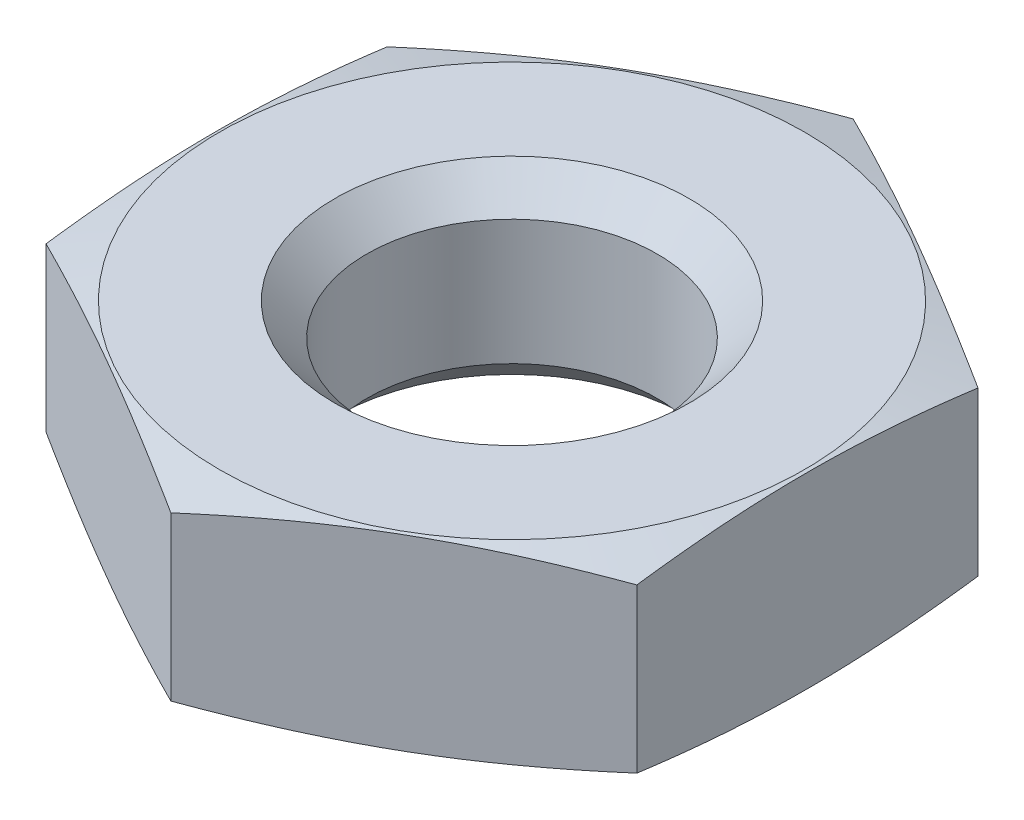
ISO-10303-21;
HEADER;
FILE_DESCRIPTION(('STEP AP214'),'2;1');
FILE_NAME('part.step','',(''),(''),'','','');
FILE_SCHEMA(('AUTOMOTIVE_DESIGN { 1 0 10303 214 1 1 1 1 }'));
ENDSEC;
DATA;
#1=APPLICATION_CONTEXT('core data for automotive mechanical design processes');
#2=APPLICATION_PROTOCOL_DEFINITION('international standard','automotive_design',2000,#1);
#3=PRODUCT_CONTEXT('',#1,'mechanical');
#4=PRODUCT('Part','Part','',(#3));
#5=PRODUCT_RELATED_PRODUCT_CATEGORY('part','',(#4));
#6=PRODUCT_DEFINITION_FORMATION('','',#4);
#7=PRODUCT_DEFINITION_CONTEXT('part definition',#1,'design');
#8=PRODUCT_DEFINITION('design','',#6,#7);
#9=PRODUCT_DEFINITION_SHAPE('','',#8);
#10=(LENGTH_UNIT() NAMED_UNIT(*) SI_UNIT(.MILLI.,.METRE.));
#11=(NAMED_UNIT(*) PLANE_ANGLE_UNIT() SI_UNIT($,.RADIAN.));
#12=(NAMED_UNIT(*) SI_UNIT($,.STERADIAN.) SOLID_ANGLE_UNIT());
#13=UNCERTAINTY_MEASURE_WITH_UNIT(LENGTH_MEASURE(1.E-05),#10,'distance_accuracy_value','');
#14=(GEOMETRIC_REPRESENTATION_CONTEXT(3) GLOBAL_UNCERTAINTY_ASSIGNED_CONTEXT((#13)) GLOBAL_UNIT_ASSIGNED_CONTEXT((#10,
#11,#12)) REPRESENTATION_CONTEXT('',''));
#15=CARTESIAN_POINT('',(0.,0.,0.));
#16=DIRECTION('',(0.,0.,1.));
#17=DIRECTION('',(1.,0.,0.));
#18=AXIS2_PLACEMENT_3D('',#15,#16,#17);
#19=CARTESIAN_POINT('',(0.,0.,0.));
#20=DIRECTION('',(0.,1.,0.));
#21=DIRECTION('',(0.,0.,1.));
#22=AXIS2_PLACEMENT_3D('',#19,#20,#21);
#23=PLANE('',#22);
#24=CARTESIAN_POINT('',(0.,0.,0.));
#25=DIRECTION('',(0.,-1.,0.));
#26=DIRECTION('',(0.,0.,-1.));
#27=AXIS2_PLACEMENT_3D('',#24,#25,#26);
#28=CIRCLE('',#27,4.95);
#29=CARTESIAN_POINT('',(0.,0.,-4.95));
#30=VERTEX_POINT('',#29);
#31=EDGE_CURVE('E114',#30,#30,#28,.T.);
#32=ORIENTED_EDGE('',*,*,#31,.F.);
#33=EDGE_LOOP('',(#32));
#34=FACE_BOUND('',#33,.T.);
#35=CARTESIAN_POINT('',(0.,0.,0.));
#36=DIRECTION('',(0.,1.,0.));
#37=DIRECTION('',(0.,0.,1.));
#38=AXIS2_PLACEMENT_3D('',#35,#36,#37);
#39=CIRCLE('',#38,3.);
#40=CARTESIAN_POINT('',(0.,0.,3.));
#41=VERTEX_POINT('',#40);
#42=EDGE_CURVE('E105',#41,#41,#39,.T.);
#43=ORIENTED_EDGE('',*,*,#42,.F.);
#44=EDGE_LOOP('',(#43));
#45=FACE_BOUND('',#44,.T.);
#46=ADVANCED_FACE('F36',(#34,#45),#23,.T.);
#47=CARTESIAN_POINT('',(4.95,-3.2,0.));
#48=DIRECTION('',(0.,-1.,0.));
#49=DIRECTION('',(0.,0.,-1.));
#50=AXIS2_PLACEMENT_3D('',#47,#48,#49);
#51=PLANE('',#50);
#52=CARTESIAN_POINT('',(0.,-3.2,0.));
#53=DIRECTION('',(0.,-1.,0.));
#54=DIRECTION('',(0.,0.,-1.));
#55=AXIS2_PLACEMENT_3D('',#52,#53,#54);
#56=CIRCLE('',#55,4.95);
#57=CARTESIAN_POINT('',(0.,-3.2,-4.95));
#58=VERTEX_POINT('',#57);
#59=EDGE_CURVE('E111',#58,#58,#56,.T.);
#60=ORIENTED_EDGE('',*,*,#59,.T.);
#61=EDGE_LOOP('',(#60));
#62=FACE_BOUND('',#61,.T.);
#63=CARTESIAN_POINT('',(0.,-3.2,0.));
#64=DIRECTION('',(0.,1.,0.));
#65=DIRECTION('',(0.,0.,1.));
#66=AXIS2_PLACEMENT_3D('',#63,#64,#65);
#67=CIRCLE('',#66,3.);
#68=CARTESIAN_POINT('',(0.,-3.2,3.));
#69=VERTEX_POINT('',#68);
#70=EDGE_CURVE('E348',#69,#69,#67,.T.);
#71=ORIENTED_EDGE('',*,*,#70,.T.);
#72=EDGE_LOOP('',(#71));
#73=FACE_BOUND('',#72,.T.);
#74=ADVANCED_FACE('F137',(#62,#73),#51,.T.);
#75=CARTESIAN_POINT('',(0.,-1.6,0.));
#76=DIRECTION('',(0.,-1.,0.));
#77=DIRECTION('',(0.,0.,-1.));
#78=AXIS2_PLACEMENT_3D('',#75,#76,#77);
#79=CONICAL_SURFACE('',#78,10.92128129211,1.30899693899574);
#80=ORIENTED_EDGE('',*,*,#31,.T.);
#81=EDGE_LOOP('',(#80));
#82=FACE_BOUND('',#81,.T.);
#83=CARTESIAN_POINT('',(0.000200000000000056,-0.220687822294338,-5.77361816195014));
#84=CARTESIAN_POINT('',(-0.207454004305664,-0.188549555804581,-5.65372906666596));
#85=CARTESIAN_POINT('',(-0.415484518325708,-0.159373272645011,-5.53362259339683));
#86=CARTESIAN_POINT('',(-0.832280248969818,-0.108113229801624,-5.29298546611236));
#87=CARTESIAN_POINT('',(-1.04104572932974,-0.0860323511907302,-5.17245465982905));
#88=CARTESIAN_POINT('',(-1.45804559853969,-0.0502522274677594,-4.93169967308864));
#89=CARTESIAN_POINT('',(-1.66627716741308,-0.0365103114883495,-4.81147712074581));
#90=CARTESIAN_POINT('',(-2.08300586365708,-0.0180838038255081,-4.57087869579028));
#91=CARTESIAN_POINT('',(-2.29150293182854,-0.0133974596215596,-4.45050285735624));
#92=CARTESIAN_POINT('',(-2.70849706817146,-0.013397459621558,-4.20975118048816));
#93=CARTESIAN_POINT('',(-2.91699413634291,-0.018083803825505,-4.08937534205412));
#94=CARTESIAN_POINT('',(-3.33372283258692,-0.0365103114883436,-3.84877691709859));
#95=CARTESIAN_POINT('',(-3.54195440146031,-0.0502522274677522,-3.72855436475576));
#96=CARTESIAN_POINT('',(-3.95895427067026,-0.0860323511907204,-3.48779937801535));
#97=CARTESIAN_POINT('',(-4.16771975103018,-0.108113229801612,-3.36726857173205));
#98=CARTESIAN_POINT('',(-4.58451548167429,-0.159373272644997,-3.12663144444758));
#99=CARTESIAN_POINT('',(-4.79254599569433,-0.188549555804566,-3.00652497117844));
#100=CARTESIAN_POINT('',(-5.0002,-0.220687822294322,-2.88663587589426));
#101=B_SPLINE_CURVE_WITH_KNOTS('',3,(#83,#84,#85,#86,#87,#88,#89,#90,#91,#92,#93,#94,#95,#96,
#97,#98,#99,#100),.UNSPECIFIED.,.F.,.F.,(4,2,2,2,2,2,2,2,4),(0.,0.725805237679813,
1.45190481561533,2.17425686883393,2.89646911159518,3.61868135435642,4.34103340757503,
5.06713298551055,5.79293822319036),.UNSPECIFIED.);
#102=CARTESIAN_POINT('',(0.,-0.220656881258476,-5.7735026918963));
#103=VERTEX_POINT('',#102);
#104=CARTESIAN_POINT('',(-5.,-0.220656881258461,-2.8867513459481));
#105=VERTEX_POINT('',#104);
#106=EDGE_CURVE('E110',#103,#105,#101,.T.);
#107=ORIENTED_EDGE('',*,*,#106,.T.);
#108=CARTESIAN_POINT('',(-5.,-1.14063800462012,-7.73093508057312));
#109=CARTESIAN_POINT('',(-5.,-1.08936240000554,-7.50297701689983));
#110=CARTESIAN_POINT('',(-5.,-1.03869834678135,-7.27487894610606));
#111=CARTESIAN_POINT('',(-5.,-0.938923659771285,-6.81833381184379));
#112=CARTESIAN_POINT('',(-5.,-0.88981309034785,-6.58988673432556));
#113=CARTESIAN_POINT('',(-5.,-0.793435996769751,-6.13238464648103));
#114=CARTESIAN_POINT('',(-5.,-0.746171197688716,-5.90332927148686));
#115=CARTESIAN_POINT('',(-5.,-0.653980649652257,-5.44474852289208));
#116=CARTESIAN_POINT('',(-5.,-0.609054881867156,-5.21522315309048));
#117=CARTESIAN_POINT('',(-5.,-0.522457178467669,-4.75749916393179));
#118=CARTESIAN_POINT('',(-5.,-0.480761654427966,-4.52930502882392));
#119=CARTESIAN_POINT('',(-5.,-0.400908035856761,-4.07229970348656));
#120=CARTESIAN_POINT('',(-5.,-0.362749865927748,-3.84348852651613));
#121=CARTESIAN_POINT('',(-5.,-0.290809760884917,-3.38519229582061));
#122=CARTESIAN_POINT('',(-5.,-0.257027472653694,-3.15570729800063));
#123=CARTESIAN_POINT('',(-5.,-0.194817345230125,-2.69600431838457));
#124=CARTESIAN_POINT('',(-5.,-0.166389515122861,-2.46578633534548));
#125=CARTESIAN_POINT('',(-5.,-0.115671295304904,-2.00197391292755));
#126=CARTESIAN_POINT('',(-5.,-0.0934555819147692,-1.76837118614386));
#127=CARTESIAN_POINT('',(-5.,-0.0566821520401409,-1.3005584399816));
#128=CARTESIAN_POINT('',(-5.,-0.0421242595760637,-1.06634843468283));
#129=CARTESIAN_POINT('',(-5.,-0.021514164560592,-0.597665832000252));
#130=CARTESIAN_POINT('',(-5.,-0.0154576510286622,-0.363193428091791));
#131=CARTESIAN_POINT('',(-5.,-0.0122246298335164,0.105813280844502));
#132=CARTESIAN_POINT('',(-5.,-0.0150480990826594,0.340347585709807));
#133=CARTESIAN_POINT('',(-5.,-0.0294192789403464,0.810061623076059));
#134=CARTESIAN_POINT('',(-5.,-0.0410010764365612,1.04524029111869));
#135=CARTESIAN_POINT('',(-5.,-0.0722219618928339,1.51505730934962));
#136=CARTESIAN_POINT('',(-5.,-0.0918612346522647,1.74969564702123));
#137=CARTESIAN_POINT('',(-5.,-0.138181917035147,2.21843069186745));
#138=CARTESIAN_POINT('',(-5.,-0.164868237309113,2.45252690607147));
#139=CARTESIAN_POINT('',(-5.,-0.224143591915323,2.9199616860284));
#140=CARTESIAN_POINT('',(-5.,-0.25673263546809,3.15330025059721));
#141=CARTESIAN_POINT('',(-5.,-0.327475954957309,3.62413082050116));
#142=CARTESIAN_POINT('',(-5.,-0.365732615812328,3.86160729789613));
#143=CARTESIAN_POINT('',(-5.,-0.446296738927151,4.33587587986845));
#144=CARTESIAN_POINT('',(-5.,-0.488604351737986,4.5726679586734));
#145=CARTESIAN_POINT('',(-5.,-0.576463930015246,5.04567613729648));
#146=CARTESIAN_POINT('',(-5.,-0.622016291427552,5.28189216317091));
#147=CARTESIAN_POINT('',(-5.,-0.715721397797306,5.75380925854518));
#148=CARTESIAN_POINT('',(-5.,-0.763874182630086,5.98951032009078));
#149=CARTESIAN_POINT('',(-5.,-0.911476013428582,6.69612400645412));
#150=CARTESIAN_POINT('',(-5.,-1.01403771661469,7.16638541494425));
#151=CARTESIAN_POINT('',(-5.,-1.22460159668864,8.10563618645675));
#152=CARTESIAN_POINT('',(-5.,-1.33260334617782,8.57462564636864));
#153=CARTESIAN_POINT('',(-5.,-1.55112057451624,9.50648852550758));
#154=CARTESIAN_POINT('',(-5.,-1.66159447228715,9.96937172128773));
#155=CARTESIAN_POINT('',(-5.,-1.88514022147479,10.8945201862102));
#156=CARTESIAN_POINT('',(-5.,-1.99821213541137,11.3567854401981));
#157=CARTESIAN_POINT('',(-5.,-2.22607496652026,12.2801616381083));
#158=CARTESIAN_POINT('',(-5.,-2.3408630760647,12.7412732761874));
#159=CARTESIAN_POINT('',(-5.,-2.57187470671301,13.6631184734053));
#160=CARTESIAN_POINT('',(-5.,-2.68809817311086,14.123852046244));
#161=CARTESIAN_POINT('',(-5.,-2.80481990525299,14.5844578389234));
#162=B_SPLINE_CURVE_WITH_KNOTS('',3,(#108,#109,#110,#111,#112,#113,#114,#115,#116,#117,#118,
#119,#120,#121,#122,#123,#124,#125,#126,#127,#128,#129,#130,#131,#132,#133,#134,#135,#136,#137,
#138,#139,#140,#141,#142,#143,#144,#145,#146,#147,#148,#149,#150,#151,#152,#153,#154,#155,#156,
#157,#158,#159,#160,#161),.UNSPECIFIED.,.F.,.F.,(4,2,2,2,2,2,2,2,2,2,2,2,2,2,2,2,2,2,2,2,2,2,2,
2,2,2,4),(0.,0.70096393152671,1.40195686677819,2.10358999826182,2.80521748058256,
3.50111173017783,4.19699114360917,4.89281436712552,5.58863877125716,6.29249959293576,
6.99634423892319,7.69983184188264,8.40331761580073,9.10955549600335,9.81580957478054,
10.5225571029144,11.2293057350535,11.9508770291112,12.6724751503193,13.3941614770934,
14.1158588734716,15.5597474703053,17.0035228040511,18.4311631202119,19.858837827816,
21.2843885766755,22.7098851599128),.UNSPECIFIED.);
#163=CARTESIAN_POINT('',(-5.,-0.220656881258461,2.8867513459481));
#164=VERTEX_POINT('',#163);
#165=EDGE_CURVE('E102',#105,#164,#162,.T.);
#166=ORIENTED_EDGE('',*,*,#165,.T.);
#167=CARTESIAN_POINT('',(-5.0002,-0.220687822294322,2.88663587589426));
#168=CARTESIAN_POINT('',(-4.79254599569434,-0.188549555804566,3.00652497117844));
#169=CARTESIAN_POINT('',(-4.58451548167429,-0.159373272644997,3.12663144444758));
#170=CARTESIAN_POINT('',(-4.16771975103018,-0.108113229801612,3.36726857173205));
#171=CARTESIAN_POINT('',(-3.95895427067026,-0.0860323511907203,3.48779937801535));
#172=CARTESIAN_POINT('',(-3.54195440146031,-0.0502522274677521,3.72855436475576));
#173=CARTESIAN_POINT('',(-3.33372283258692,-0.0365103114883434,3.84877691709859));
#174=CARTESIAN_POINT('',(-2.91699413634291,-0.018083803825505,4.08937534205412));
#175=CARTESIAN_POINT('',(-2.70849706817146,-0.0133974596215581,4.20975118048816));
#176=CARTESIAN_POINT('',(-2.29150293182854,-0.0133974596215597,4.45050285735624));
#177=CARTESIAN_POINT('',(-2.08300586365708,-0.0180838038255082,4.57087869579028));
#178=CARTESIAN_POINT('',(-1.66627716741308,-0.0365103114883494,4.81147712074581));
#179=CARTESIAN_POINT('',(-1.45804559853969,-0.0502522274677593,4.93169967308864));
#180=CARTESIAN_POINT('',(-1.04104572932974,-0.0860323511907301,5.17245465982905));
#181=CARTESIAN_POINT('',(-0.832280248969818,-0.108113229801623,5.29298546611236));
#182=CARTESIAN_POINT('',(-0.415484518325707,-0.159373272645011,5.53362259339683));
#183=CARTESIAN_POINT('',(-0.207454004305664,-0.188549555804581,5.65372906666596));
#184=CARTESIAN_POINT('',(0.000200000000000415,-0.220687822294338,5.77361816195014));
#185=B_SPLINE_CURVE_WITH_KNOTS('',3,(#167,#168,#169,#170,#171,#172,#173,#174,#175,#176,#177,
#178,#179,#180,#181,#182,#183,#184),.UNSPECIFIED.,.F.,.F.,(4,2,2,2,2,2,2,2,4),(0.,
0.725805237679813,1.45190481561533,2.17425686883394,2.89646911159518,3.61868135435643,
4.34103340757503,5.06713298551055,5.79293822319036),.UNSPECIFIED.);
#186=CARTESIAN_POINT('',(0.,-0.220656881258477,5.7735026918963));
#187=VERTEX_POINT('',#186);
#188=EDGE_CURVE('E91',#164,#187,#185,.T.);
#189=ORIENTED_EDGE('',*,*,#188,.T.);
#190=CARTESIAN_POINT('',(-0.000200000000000056,-0.220687822294338,5.77361816195014));
#191=CARTESIAN_POINT('',(0.207454004305664,-0.188549555804581,5.65372906666596));
#192=CARTESIAN_POINT('',(0.415484518325708,-0.159373272645011,5.53362259339683));
#193=CARTESIAN_POINT('',(0.832280248969818,-0.108113229801624,5.29298546611236));
#194=CARTESIAN_POINT('',(1.04104572932974,-0.0860323511907302,5.17245465982905));
#195=CARTESIAN_POINT('',(1.45804559853969,-0.0502522274677594,4.93169967308864));
#196=CARTESIAN_POINT('',(1.66627716741308,-0.0365103114883495,4.81147712074581));
#197=CARTESIAN_POINT('',(2.08300586365708,-0.0180838038255081,4.57087869579028));
#198=CARTESIAN_POINT('',(2.29150293182854,-0.0133974596215596,4.45050285735624));
#199=CARTESIAN_POINT('',(2.70849706817146,-0.013397459621558,4.20975118048816));
#200=CARTESIAN_POINT('',(2.91699413634291,-0.018083803825505,4.08937534205412));
#201=CARTESIAN_POINT('',(3.33372283258692,-0.0365103114883436,3.84877691709859));
#202=CARTESIAN_POINT('',(3.54195440146031,-0.0502522274677522,3.72855436475576));
#203=CARTESIAN_POINT('',(3.95895427067026,-0.0860323511907204,3.48779937801535));
#204=CARTESIAN_POINT('',(4.16771975103018,-0.108113229801612,3.36726857173205));
#205=CARTESIAN_POINT('',(4.58451548167429,-0.159373272644997,3.12663144444758));
#206=CARTESIAN_POINT('',(4.79254599569433,-0.188549555804566,3.00652497117844));
#207=CARTESIAN_POINT('',(5.0002,-0.220687822294322,2.88663587589426));
#208=B_SPLINE_CURVE_WITH_KNOTS('',3,(#190,#191,#192,#193,#194,#195,#196,#197,#198,#199,#200,
#201,#202,#203,#204,#205,#206,#207),.UNSPECIFIED.,.F.,.F.,(4,2,2,2,2,2,2,2,4),(0.,
0.725805237679813,1.45190481561533,2.17425686883393,2.89646911159518,3.61868135435642,
4.34103340757503,5.06713298551055,5.79293822319036),.UNSPECIFIED.);
#209=CARTESIAN_POINT('',(5.,-0.220656881258461,2.8867513459481));
#210=VERTEX_POINT('',#209);
#211=EDGE_CURVE('E96',#187,#210,#208,.T.);
#212=ORIENTED_EDGE('',*,*,#211,.T.);
#213=CARTESIAN_POINT('',(5.,-1.14063800462012,-7.73093508057312));
#214=CARTESIAN_POINT('',(5.,-1.08936240000554,-7.50297701689983));
#215=CARTESIAN_POINT('',(5.,-1.03869834678135,-7.27487894610606));
#216=CARTESIAN_POINT('',(5.,-0.938923659771285,-6.81833381184379));
#217=CARTESIAN_POINT('',(5.,-0.88981309034785,-6.58988673432556));
#218=CARTESIAN_POINT('',(5.,-0.793435996769751,-6.13238464648103));
#219=CARTESIAN_POINT('',(5.,-0.746171197688716,-5.90332927148686));
#220=CARTESIAN_POINT('',(5.,-0.653980649652257,-5.44474852289208));
#221=CARTESIAN_POINT('',(5.,-0.609054881867156,-5.21522315309048));
#222=CARTESIAN_POINT('',(5.,-0.522457178467669,-4.75749916393179));
#223=CARTESIAN_POINT('',(5.,-0.480761654427966,-4.52930502882392));
#224=CARTESIAN_POINT('',(5.,-0.400908035856761,-4.07229970348656));
#225=CARTESIAN_POINT('',(5.,-0.362749865927748,-3.84348852651613));
#226=CARTESIAN_POINT('',(5.,-0.290809760884917,-3.38519229582061));
#227=CARTESIAN_POINT('',(5.,-0.257027472653694,-3.15570729800063));
#228=CARTESIAN_POINT('',(5.,-0.194817345230125,-2.69600431838457));
#229=CARTESIAN_POINT('',(5.,-0.166389515122861,-2.46578633534548));
#230=CARTESIAN_POINT('',(5.,-0.115671295304904,-2.00197391292755));
#231=CARTESIAN_POINT('',(5.,-0.0934555819147692,-1.76837118614386));
#232=CARTESIAN_POINT('',(5.,-0.0566821520401409,-1.3005584399816));
#233=CARTESIAN_POINT('',(5.,-0.0421242595760637,-1.06634843468283));
#234=CARTESIAN_POINT('',(5.,-0.021514164560592,-0.597665832000252));
#235=CARTESIAN_POINT('',(5.,-0.0154576510286622,-0.363193428091791));
#236=CARTESIAN_POINT('',(5.,-0.0122246298335164,0.105813280844502));
#237=CARTESIAN_POINT('',(5.,-0.0150480990826594,0.340347585709807));
#238=CARTESIAN_POINT('',(5.,-0.0294192789403464,0.810061623076059));
#239=CARTESIAN_POINT('',(5.,-0.0410010764365612,1.04524029111869));
#240=CARTESIAN_POINT('',(5.,-0.0722219618928339,1.51505730934962));
#241=CARTESIAN_POINT('',(5.,-0.0918612346522647,1.74969564702123));
#242=CARTESIAN_POINT('',(5.,-0.138181917035147,2.21843069186745));
#243=CARTESIAN_POINT('',(5.,-0.164868237309113,2.45252690607147));
#244=CARTESIAN_POINT('',(5.,-0.224143591915323,2.9199616860284));
#245=CARTESIAN_POINT('',(5.,-0.25673263546809,3.15330025059721));
#246=CARTESIAN_POINT('',(5.,-0.327475954957309,3.62413082050116));
#247=CARTESIAN_POINT('',(5.,-0.365732615812328,3.86160729789613));
#248=CARTESIAN_POINT('',(5.,-0.446296738927151,4.33587587986845));
#249=CARTESIAN_POINT('',(5.,-0.488604351737986,4.5726679586734));
#250=CARTESIAN_POINT('',(5.,-0.576463930015246,5.04567613729648));
#251=CARTESIAN_POINT('',(5.,-0.622016291427552,5.28189216317091));
#252=CARTESIAN_POINT('',(5.,-0.715721397797306,5.75380925854518));
#253=CARTESIAN_POINT('',(5.,-0.763874182630086,5.98951032009078));
#254=CARTESIAN_POINT('',(5.,-0.911476013428582,6.69612400645412));
#255=CARTESIAN_POINT('',(5.,-1.01403771661469,7.16638541494425));
#256=CARTESIAN_POINT('',(5.,-1.22460159668864,8.10563618645675));
#257=CARTESIAN_POINT('',(5.,-1.33260334617782,8.57462564636864));
#258=CARTESIAN_POINT('',(5.,-1.55112057451624,9.50648852550758));
#259=CARTESIAN_POINT('',(5.,-1.66159447228715,9.96937172128773));
#260=CARTESIAN_POINT('',(5.,-1.88514022147479,10.8945201862102));
#261=CARTESIAN_POINT('',(5.,-1.99821213541137,11.3567854401981));
#262=CARTESIAN_POINT('',(5.,-2.22607496652026,12.2801616381083));
#263=CARTESIAN_POINT('',(5.,-2.3408630760647,12.7412732761874));
#264=CARTESIAN_POINT('',(5.,-2.57187470671301,13.6631184734053));
#265=CARTESIAN_POINT('',(5.,-2.68809817311086,14.123852046244));
#266=CARTESIAN_POINT('',(5.,-2.80481990525299,14.5844578389234));
#267=B_SPLINE_CURVE_WITH_KNOTS('',3,(#213,#214,#215,#216,#217,#218,#219,#220,#221,#222,#223,
#224,#225,#226,#227,#228,#229,#230,#231,#232,#233,#234,#235,#236,#237,#238,#239,#240,#241,#242,
#243,#244,#245,#246,#247,#248,#249,#250,#251,#252,#253,#254,#255,#256,#257,#258,#259,#260,#261,
#262,#263,#264,#265,#266),.UNSPECIFIED.,.F.,.F.,(4,2,2,2,2,2,2,2,2,2,2,2,2,2,2,2,2,2,2,2,2,2,2,
2,2,2,4),(0.,0.70096393152671,1.40195686677819,2.10358999826182,2.80521748058256,
3.50111173017783,4.19699114360917,4.89281436712552,5.58863877125716,6.29249959293576,
6.99634423892319,7.69983184188264,8.40331761580073,9.10955549600335,9.81580957478054,
10.5225571029144,11.2293057350535,11.9508770291112,12.6724751503193,13.3941614770934,
14.1158588734716,15.5597474703053,17.0035228040511,18.4311631202119,19.858837827816,
21.2843885766755,22.7098851599128),.UNSPECIFIED.);
#268=CARTESIAN_POINT('',(5.,-0.220656881258461,-2.8867513459481));
#269=VERTEX_POINT('',#268);
#270=EDGE_CURVE('E200',#210,#269,#267,.F.);
#271=ORIENTED_EDGE('',*,*,#270,.T.);
#272=CARTESIAN_POINT('',(5.0002,-0.220687822294322,-2.88663587589426));
#273=CARTESIAN_POINT('',(4.79254599569434,-0.188549555804566,-3.00652497117844));
#274=CARTESIAN_POINT('',(4.58451548167429,-0.159373272644997,-3.12663144444758));
#275=CARTESIAN_POINT('',(4.16771975103018,-0.108113229801612,-3.36726857173205));
#276=CARTESIAN_POINT('',(3.95895427067026,-0.0860323511907203,-3.48779937801535));
#277=CARTESIAN_POINT('',(3.54195440146031,-0.0502522274677521,-3.72855436475576));
#278=CARTESIAN_POINT('',(3.33372283258692,-0.0365103114883434,-3.84877691709859));
#279=CARTESIAN_POINT('',(2.91699413634291,-0.018083803825505,-4.08937534205412));
#280=CARTESIAN_POINT('',(2.70849706817146,-0.0133974596215581,-4.20975118048816));
#281=CARTESIAN_POINT('',(2.29150293182854,-0.0133974596215597,-4.45050285735624));
#282=CARTESIAN_POINT('',(2.08300586365708,-0.0180838038255082,-4.57087869579028));
#283=CARTESIAN_POINT('',(1.66627716741308,-0.0365103114883494,-4.81147712074581));
#284=CARTESIAN_POINT('',(1.45804559853969,-0.0502522274677593,-4.93169967308864));
#285=CARTESIAN_POINT('',(1.04104572932974,-0.0860323511907301,-5.17245465982905));
#286=CARTESIAN_POINT('',(0.832280248969818,-0.108113229801623,-5.29298546611236));
#287=CARTESIAN_POINT('',(0.415484518325707,-0.159373272645011,-5.53362259339683));
#288=CARTESIAN_POINT('',(0.207454004305664,-0.188549555804581,-5.65372906666596));
#289=CARTESIAN_POINT('',(-0.000200000000000415,-0.220687822294338,-5.77361816195014));
#290=B_SPLINE_CURVE_WITH_KNOTS('',3,(#272,#273,#274,#275,#276,#277,#278,#279,#280,#281,#282,
#283,#284,#285,#286,#287,#288,#289),.UNSPECIFIED.,.F.,.F.,(4,2,2,2,2,2,2,2,4),(0.,
0.725805237679813,1.45190481561533,2.17425686883394,2.89646911159518,3.61868135435643,
4.34103340757503,5.06713298551055,5.79293822319036),.UNSPECIFIED.);
#291=EDGE_CURVE('E116',#269,#103,#290,.T.);
#292=ORIENTED_EDGE('',*,*,#291,.T.);
#293=EDGE_LOOP('',(#107,#166,#189,#212,#271,#292));
#294=FACE_BOUND('',#293,.T.);
#295=ADVANCED_FACE('F108',(#82,#294),#79,.T.);
#296=CARTESIAN_POINT('',(-5.,-4.2,-2.8867513459481));
#297=DIRECTION('',(-1.,0.,0.));
#298=DIRECTION('',(0.,0.,1.));
#299=AXIS2_PLACEMENT_3D('',#296,#297,#298);
#300=PLANE('',#299);
#301=DIRECTION('',(0.,1.,0.));
#302=VECTOR('',#301,1.);
#303=CARTESIAN_POINT('',(-5.,-4.2,-2.8867513459481));
#304=LINE('',#303,#302);
#305=CARTESIAN_POINT('',(-5.,-2.97934311874154,-2.8867513459481));
#306=VERTEX_POINT('',#305);
#307=EDGE_CURVE('E97',#306,#105,#304,.T.);
#308=ORIENTED_EDGE('',*,*,#307,.F.);
#309=CARTESIAN_POINT('',(-5.,-2.05936199537988,-7.73093508057312));
#310=CARTESIAN_POINT('',(-5.,-2.11063759999446,-7.50297701689983));
#311=CARTESIAN_POINT('',(-5.,-2.16130165321865,-7.27487894610606));
#312=CARTESIAN_POINT('',(-5.,-2.26107634022872,-6.81833381184379));
#313=CARTESIAN_POINT('',(-5.,-2.31018690965215,-6.58988673432556));
#314=CARTESIAN_POINT('',(-5.,-2.40656400323025,-6.13238464648103));
#315=CARTESIAN_POINT('',(-5.,-2.45382880231129,-5.90332927148686));
#316=CARTESIAN_POINT('',(-5.,-2.54601935034774,-5.44474852289208));
#317=CARTESIAN_POINT('',(-5.,-2.59094511813284,-5.21522315309048));
#318=CARTESIAN_POINT('',(-5.,-2.67754282153233,-4.75749916393179));
#319=CARTESIAN_POINT('',(-5.,-2.71923834557203,-4.52930502882392));
#320=CARTESIAN_POINT('',(-5.,-2.79909196414324,-4.07229970348656));
#321=CARTESIAN_POINT('',(-5.,-2.83725013407225,-3.84348852651613));
#322=CARTESIAN_POINT('',(-5.,-2.90919023911508,-3.38519229582061));
#323=CARTESIAN_POINT('',(-5.,-2.94297252734631,-3.15570729800063));
#324=CARTESIAN_POINT('',(-5.,-3.00518265476988,-2.69600431838457));
#325=CARTESIAN_POINT('',(-5.,-3.03361048487714,-2.46578633534548));
#326=CARTESIAN_POINT('',(-5.,-3.0843287046951,-2.00197391292755));
#327=CARTESIAN_POINT('',(-5.,-3.10654441808523,-1.76837118614386));
#328=CARTESIAN_POINT('',(-5.,-3.14331784795986,-1.3005584399816));
#329=CARTESIAN_POINT('',(-5.,-3.15787574042394,-1.06634843468283));
#330=CARTESIAN_POINT('',(-5.,-3.17848583543941,-0.597665832000251));
#331=CARTESIAN_POINT('',(-5.,-3.18454234897134,-0.36319342809179));
#332=CARTESIAN_POINT('',(-5.,-3.18777537016648,0.105813280844502));
#333=CARTESIAN_POINT('',(-5.,-3.18495190091734,0.340347585709807));
#334=CARTESIAN_POINT('',(-5.,-3.17058072105965,0.810061623076059));
#335=CARTESIAN_POINT('',(-5.,-3.15899892356344,1.04524029111869));
#336=CARTESIAN_POINT('',(-5.,-3.12777803810717,1.51505730934962));
#337=CARTESIAN_POINT('',(-5.,-3.10813876534774,1.74969564702123));
#338=CARTESIAN_POINT('',(-5.,-3.06181808296485,2.21843069186745));
#339=CARTESIAN_POINT('',(-5.,-3.03513176269089,2.45252690607147));
#340=CARTESIAN_POINT('',(-5.,-2.97585640808468,2.9199616860284));
#341=CARTESIAN_POINT('',(-5.,-2.94326736453191,3.15330025059721));
#342=CARTESIAN_POINT('',(-5.,-2.87252404504269,3.62413082050116));
#343=CARTESIAN_POINT('',(-5.,-2.83426738418767,3.86160729789613));
#344=CARTESIAN_POINT('',(-5.,-2.75370326107285,4.33587587986845));
#345=CARTESIAN_POINT('',(-5.,-2.71139564826201,4.57266795867341));
#346=CARTESIAN_POINT('',(-5.,-2.62353606998475,5.04567613729648));
#347=CARTESIAN_POINT('',(-5.,-2.57798370857245,5.28189216317091));
#348=CARTESIAN_POINT('',(-5.,-2.48427860220269,5.75380925854518));
#349=CARTESIAN_POINT('',(-5.,-2.43612581736991,5.98951032009078));
#350=CARTESIAN_POINT('',(-5.,-2.28852398657142,6.69612400645412));
#351=CARTESIAN_POINT('',(-5.,-2.18596228338531,7.16638541494425));
#352=CARTESIAN_POINT('',(-5.,-1.97539840331136,8.10563618645675));
#353=CARTESIAN_POINT('',(-5.,-1.86739665382219,8.57462564636864));
#354=CARTESIAN_POINT('',(-5.,-1.64887942548376,9.50648852550758));
#355=CARTESIAN_POINT('',(-5.,-1.53840552771285,9.96937172128773));
#356=CARTESIAN_POINT('',(-5.,-1.31485977852521,10.8945201862102));
#357=CARTESIAN_POINT('',(-5.,-1.20178786458863,11.3567854401981));
#358=CARTESIAN_POINT('',(-5.,-0.973925033479745,12.2801616381083));
#359=CARTESIAN_POINT('',(-5.,-0.859136923935303,12.7412732761874));
#360=CARTESIAN_POINT('',(-5.,-0.62812529328699,13.6631184734053));
#361=CARTESIAN_POINT('',(-5.,-0.511901826889137,14.123852046244));
#362=CARTESIAN_POINT('',(-5.,-0.395180094747009,14.5844578389234));
#363=B_SPLINE_CURVE_WITH_KNOTS('',3,(#309,#310,#311,#312,#313,#314,#315,#316,#317,#318,#319,
#320,#321,#322,#323,#324,#325,#326,#327,#328,#329,#330,#331,#332,#333,#334,#335,#336,#337,#338,
#339,#340,#341,#342,#343,#344,#345,#346,#347,#348,#349,#350,#351,#352,#353,#354,#355,#356,#357,
#358,#359,#360,#361,#362),.UNSPECIFIED.,.F.,.F.,(4,2,2,2,2,2,2,2,2,2,2,2,2,2,2,2,2,2,2,2,2,2,2,
2,2,2,4),(0.,0.70096393152671,1.40195686677819,2.10358999826182,2.80521748058256,
3.50111173017783,4.19699114360917,4.89281436712552,5.58863877125716,6.29249959293576,
6.99634423892319,7.69983184188264,8.40331761580073,9.10955549600335,9.81580957478054,
10.5225571029144,11.2293057350535,11.9508770291112,12.6724751503193,13.3941614770934,
14.1158588734716,15.5597474703053,17.0035228040511,18.4311631202119,19.858837827816,
21.2843885766755,22.7098851599128),.UNSPECIFIED.);
#364=CARTESIAN_POINT('',(-5.,-2.97934311874154,2.8867513459481));
#365=VERTEX_POINT('',#364);
#366=EDGE_CURVE('E11',#365,#306,#363,.F.);
#367=ORIENTED_EDGE('',*,*,#366,.F.);
#368=DIRECTION('',(0.,1.,0.));
#369=VECTOR('',#368,1.);
#370=CARTESIAN_POINT('',(-5.,-4.2,2.8867513459481));
#371=LINE('',#370,#369);
#372=EDGE_CURVE('E61',#365,#164,#371,.T.);
#373=ORIENTED_EDGE('',*,*,#372,.T.);
#374=ORIENTED_EDGE('',*,*,#165,.F.);
#375=EDGE_LOOP('',(#308,#367,#373,#374));
#376=FACE_BOUND('',#375,.T.);
#377=ADVANCED_FACE('F101',(#376),#300,.T.);
#378=CARTESIAN_POINT('',(0.,-4.2,-5.7735026918963));
#379=DIRECTION('',(-0.500000000000009,0.,-0.866025403784433));
#380=DIRECTION('',(-0.866025403784433,0.,0.500000000000009));
#381=AXIS2_PLACEMENT_3D('',#378,#379,#380);
#382=PLANE('',#381);
#383=DIRECTION('',(0.,1.,0.));
#384=VECTOR('',#383,1.);
#385=CARTESIAN_POINT('',(0.,-4.2,-5.7735026918963));
#386=LINE('',#385,#384);
#387=CARTESIAN_POINT('',(0.,-2.97934311874152,-5.7735026918963));
#388=VERTEX_POINT('',#387);
#389=EDGE_CURVE('E243',#388,#103,#386,.T.);
#390=ORIENTED_EDGE('',*,*,#389,.F.);
#391=CARTESIAN_POINT('',(-5.0002,-2.97931217770568,-2.88663587589426));
#392=CARTESIAN_POINT('',(-4.79254599569433,-3.01145044419543,-3.00652497117844));
#393=CARTESIAN_POINT('',(-4.58451548167429,-3.040626727355,-3.12663144444758));
#394=CARTESIAN_POINT('',(-4.16771975103018,-3.09188677019839,-3.36726857173205));
#395=CARTESIAN_POINT('',(-3.95895427067026,-3.11396764880928,-3.48779937801535));
#396=CARTESIAN_POINT('',(-3.54195440146031,-3.14974777253225,-3.72855436475576));
#397=CARTESIAN_POINT('',(-3.33372283258692,-3.16348968851166,-3.84877691709859));
#398=CARTESIAN_POINT('',(-2.91699413634291,-3.1819161961745,-4.08937534205412));
#399=CARTESIAN_POINT('',(-2.70849706817146,-3.18660254037844,-4.20975118048816));
#400=CARTESIAN_POINT('',(-2.29150293182854,-3.18660254037844,-4.45050285735624));
#401=CARTESIAN_POINT('',(-2.08300586365708,-3.18191619617449,-4.57087869579028));
#402=CARTESIAN_POINT('',(-1.66627716741308,-3.16348968851165,-4.81147712074581));
#403=CARTESIAN_POINT('',(-1.45804559853969,-3.14974777253224,-4.93169967308864));
#404=CARTESIAN_POINT('',(-1.04104572932974,-3.11396764880927,-5.17245465982905));
#405=CARTESIAN_POINT('',(-0.832280248969818,-3.09188677019838,-5.29298546611236));
#406=CARTESIAN_POINT('',(-0.415484518325708,-3.04062672735499,-5.53362259339683));
#407=CARTESIAN_POINT('',(-0.207454004305664,-3.01145044419542,-5.65372906666596));
#408=CARTESIAN_POINT('',(0.000200000000000204,-2.97931217770566,-5.77361816195014));
#409=B_SPLINE_CURVE_WITH_KNOTS('',3,(#391,#392,#393,#394,#395,#396,#397,#398,#399,#400,#401,
#402,#403,#404,#405,#406,#407,#408),.UNSPECIFIED.,.F.,.F.,(4,2,2,2,2,2,2,2,4),(0.,
0.725805237679813,1.45190481561533,2.17425686883394,2.89646911159518,3.61868135435642,
4.34103340757503,5.06713298551055,5.79293822319036),.UNSPECIFIED.);
#410=EDGE_CURVE('E49',#306,#388,#409,.T.);
#411=ORIENTED_EDGE('',*,*,#410,.F.);
#412=ORIENTED_EDGE('',*,*,#307,.T.);
#413=ORIENTED_EDGE('',*,*,#106,.F.);
#414=EDGE_LOOP('',(#390,#411,#412,#413));
#415=FACE_BOUND('',#414,.T.);
#416=ADVANCED_FACE('F134',(#415),#382,.T.);
#417=CARTESIAN_POINT('',(5.,-4.2,-2.8867513459481));
#418=DIRECTION('',(0.500000000000009,0.,-0.866025403784433));
#419=DIRECTION('',(-0.866025403784433,0.,-0.500000000000009));
#420=AXIS2_PLACEMENT_3D('',#417,#418,#419);
#421=PLANE('',#420);
#422=DIRECTION('',(0.,1.,0.));
#423=VECTOR('',#422,1.);
#424=CARTESIAN_POINT('',(5.,-4.2,-2.8867513459481));
#425=LINE('',#424,#423);
#426=CARTESIAN_POINT('',(5.,-2.97934311874154,-2.8867513459481));
#427=VERTEX_POINT('',#426);
#428=EDGE_CURVE('E246',#427,#269,#425,.T.);
#429=ORIENTED_EDGE('',*,*,#428,.F.);
#430=CARTESIAN_POINT('',(-0.0002,-2.97931217770566,-5.77361816195014));
#431=CARTESIAN_POINT('',(0.207454004305665,-3.01145044419542,-5.65372906666596));
#432=CARTESIAN_POINT('',(0.415484518325708,-3.04062672735499,-5.53362259339683));
#433=CARTESIAN_POINT('',(0.832280248969818,-3.09188677019838,-5.29298546611236));
#434=CARTESIAN_POINT('',(1.04104572932974,-3.11396764880927,-5.17245465982905));
#435=CARTESIAN_POINT('',(1.45804559853969,-3.14974777253224,-4.93169967308864));
#436=CARTESIAN_POINT('',(1.66627716741308,-3.16348968851165,-4.81147712074581));
#437=CARTESIAN_POINT('',(2.08300586365708,-3.18191619617449,-4.57087869579028));
#438=CARTESIAN_POINT('',(2.29150293182854,-3.18660254037844,-4.45050285735624));
#439=CARTESIAN_POINT('',(2.70849706817146,-3.18660254037844,-4.20975118048816));
#440=CARTESIAN_POINT('',(2.91699413634291,-3.1819161961745,-4.08937534205412));
#441=CARTESIAN_POINT('',(3.33372283258692,-3.16348968851166,-3.84877691709859));
#442=CARTESIAN_POINT('',(3.54195440146031,-3.14974777253225,-3.72855436475576));
#443=CARTESIAN_POINT('',(3.95895427067026,-3.11396764880928,-3.48779937801535));
#444=CARTESIAN_POINT('',(4.16771975103018,-3.09188677019839,-3.36726857173205));
#445=CARTESIAN_POINT('',(4.58451548167429,-3.040626727355,-3.12663144444758));
#446=CARTESIAN_POINT('',(4.79254599569433,-3.01145044419543,-3.00652497117844));
#447=CARTESIAN_POINT('',(5.0002,-2.97931217770568,-2.88663587589426));
#448=B_SPLINE_CURVE_WITH_KNOTS('',3,(#430,#431,#432,#433,#434,#435,#436,#437,#438,#439,#440,
#441,#442,#443,#444,#445,#446,#447),.UNSPECIFIED.,.F.,.F.,(4,2,2,2,2,2,2,2,4),(0.,
0.725805237679812,1.45190481561533,2.17425686883393,2.89646911159518,3.61868135435642,
4.34103340757503,5.06713298551055,5.79293822319036),.UNSPECIFIED.);
#449=EDGE_CURVE('E171',#388,#427,#448,.T.);
#450=ORIENTED_EDGE('',*,*,#449,.F.);
#451=ORIENTED_EDGE('',*,*,#389,.T.);
#452=ORIENTED_EDGE('',*,*,#291,.F.);
#453=EDGE_LOOP('',(#429,#450,#451,#452));
#454=FACE_BOUND('',#453,.T.);
#455=ADVANCED_FACE('F185',(#454),#421,.T.);
#456=CARTESIAN_POINT('',(5.,-4.2,2.8867513459481));
#457=DIRECTION('',(1.,0.,0.));
#458=DIRECTION('',(0.,0.,-1.));
#459=AXIS2_PLACEMENT_3D('',#456,#457,#458);
#460=PLANE('',#459);
#461=DIRECTION('',(0.,1.,0.));
#462=VECTOR('',#461,1.);
#463=CARTESIAN_POINT('',(5.,-4.2,2.8867513459481));
#464=LINE('',#463,#462);
#465=CARTESIAN_POINT('',(5.,-2.97934311874154,2.8867513459481));
#466=VERTEX_POINT('',#465);
#467=EDGE_CURVE('E249',#466,#210,#464,.T.);
#468=ORIENTED_EDGE('',*,*,#467,.F.);
#469=CARTESIAN_POINT('',(5.,-2.05936199537988,-7.73093508057312));
#470=CARTESIAN_POINT('',(5.,-2.11063759999446,-7.50297701689983));
#471=CARTESIAN_POINT('',(5.,-2.16130165321865,-7.27487894610606));
#472=CARTESIAN_POINT('',(5.,-2.26107634022872,-6.81833381184379));
#473=CARTESIAN_POINT('',(5.,-2.31018690965215,-6.58988673432556));
#474=CARTESIAN_POINT('',(5.,-2.40656400323025,-6.13238464648103));
#475=CARTESIAN_POINT('',(5.,-2.45382880231129,-5.90332927148686));
#476=CARTESIAN_POINT('',(5.,-2.54601935034774,-5.44474852289208));
#477=CARTESIAN_POINT('',(5.,-2.59094511813284,-5.21522315309048));
#478=CARTESIAN_POINT('',(5.,-2.67754282153233,-4.75749916393179));
#479=CARTESIAN_POINT('',(5.,-2.71923834557203,-4.52930502882392));
#480=CARTESIAN_POINT('',(5.,-2.79909196414324,-4.07229970348656));
#481=CARTESIAN_POINT('',(5.,-2.83725013407225,-3.84348852651613));
#482=CARTESIAN_POINT('',(5.,-2.90919023911508,-3.38519229582061));
#483=CARTESIAN_POINT('',(5.,-2.94297252734631,-3.15570729800063));
#484=CARTESIAN_POINT('',(5.,-3.00518265476988,-2.69600431838457));
#485=CARTESIAN_POINT('',(5.,-3.03361048487714,-2.46578633534548));
#486=CARTESIAN_POINT('',(5.,-3.0843287046951,-2.00197391292755));
#487=CARTESIAN_POINT('',(5.,-3.10654441808523,-1.76837118614386));
#488=CARTESIAN_POINT('',(5.,-3.14331784795986,-1.3005584399816));
#489=CARTESIAN_POINT('',(5.,-3.15787574042394,-1.06634843468283));
#490=CARTESIAN_POINT('',(5.,-3.17848583543941,-0.597665832000251));
#491=CARTESIAN_POINT('',(5.,-3.18454234897134,-0.36319342809179));
#492=CARTESIAN_POINT('',(5.,-3.18777537016648,0.105813280844502));
#493=CARTESIAN_POINT('',(5.,-3.18495190091734,0.340347585709807));
#494=CARTESIAN_POINT('',(5.,-3.17058072105965,0.810061623076059));
#495=CARTESIAN_POINT('',(5.,-3.15899892356344,1.04524029111869));
#496=CARTESIAN_POINT('',(5.,-3.12777803810717,1.51505730934962));
#497=CARTESIAN_POINT('',(5.,-3.10813876534774,1.74969564702123));
#498=CARTESIAN_POINT('',(5.,-3.06181808296485,2.21843069186745));
#499=CARTESIAN_POINT('',(5.,-3.03513176269089,2.45252690607147));
#500=CARTESIAN_POINT('',(5.,-2.97585640808468,2.9199616860284));
#501=CARTESIAN_POINT('',(5.,-2.94326736453191,3.15330025059721));
#502=CARTESIAN_POINT('',(5.,-2.87252404504269,3.62413082050116));
#503=CARTESIAN_POINT('',(5.,-2.83426738418767,3.86160729789613));
#504=CARTESIAN_POINT('',(5.,-2.75370326107285,4.33587587986845));
#505=CARTESIAN_POINT('',(5.,-2.71139564826201,4.57266795867341));
#506=CARTESIAN_POINT('',(5.,-2.62353606998475,5.04567613729648));
#507=CARTESIAN_POINT('',(5.,-2.57798370857245,5.28189216317091));
#508=CARTESIAN_POINT('',(5.,-2.48427860220269,5.75380925854518));
#509=CARTESIAN_POINT('',(5.,-2.43612581736991,5.98951032009078));
#510=CARTESIAN_POINT('',(5.,-2.28852398657142,6.69612400645412));
#511=CARTESIAN_POINT('',(5.,-2.18596228338531,7.16638541494425));
#512=CARTESIAN_POINT('',(5.,-1.97539840331136,8.10563618645675));
#513=CARTESIAN_POINT('',(5.,-1.86739665382219,8.57462564636864));
#514=CARTESIAN_POINT('',(5.,-1.64887942548376,9.50648852550758));
#515=CARTESIAN_POINT('',(5.,-1.53840552771285,9.96937172128773));
#516=CARTESIAN_POINT('',(5.,-1.31485977852521,10.8945201862102));
#517=CARTESIAN_POINT('',(5.,-1.20178786458863,11.3567854401981));
#518=CARTESIAN_POINT('',(5.,-0.973925033479745,12.2801616381083));
#519=CARTESIAN_POINT('',(5.,-0.859136923935303,12.7412732761874));
#520=CARTESIAN_POINT('',(5.,-0.62812529328699,13.6631184734053));
#521=CARTESIAN_POINT('',(5.,-0.511901826889137,14.123852046244));
#522=CARTESIAN_POINT('',(5.,-0.395180094747009,14.5844578389234));
#523=B_SPLINE_CURVE_WITH_KNOTS('',3,(#469,#470,#471,#472,#473,#474,#475,#476,#477,#478,#479,
#480,#481,#482,#483,#484,#485,#486,#487,#488,#489,#490,#491,#492,#493,#494,#495,#496,#497,#498,
#499,#500,#501,#502,#503,#504,#505,#506,#507,#508,#509,#510,#511,#512,#513,#514,#515,#516,#517,
#518,#519,#520,#521,#522),.UNSPECIFIED.,.F.,.F.,(4,2,2,2,2,2,2,2,2,2,2,2,2,2,2,2,2,2,2,2,2,2,2,
2,2,2,4),(0.,0.70096393152671,1.40195686677819,2.10358999826182,2.80521748058256,
3.50111173017783,4.19699114360917,4.89281436712552,5.58863877125716,6.29249959293576,
6.99634423892319,7.69983184188264,8.40331761580073,9.10955549600335,9.81580957478054,
10.5225571029144,11.2293057350535,11.9508770291112,12.6724751503193,13.3941614770934,
14.1158588734716,15.5597474703053,17.0035228040511,18.4311631202119,19.858837827816,
21.2843885766755,22.7098851599128),.UNSPECIFIED.);
#524=EDGE_CURVE('E164',#427,#466,#523,.T.);
#525=ORIENTED_EDGE('',*,*,#524,.F.);
#526=ORIENTED_EDGE('',*,*,#428,.T.);
#527=ORIENTED_EDGE('',*,*,#270,.F.);
#528=EDGE_LOOP('',(#468,#525,#526,#527));
#529=FACE_BOUND('',#528,.T.);
#530=ADVANCED_FACE('F191',(#529),#460,.T.);
#531=CARTESIAN_POINT('',(0.,-4.2,5.7735026918963));
#532=DIRECTION('',(0.500000000000009,0.,0.866025403784433));
#533=DIRECTION('',(0.866025403784433,0.,-0.500000000000009));
#534=AXIS2_PLACEMENT_3D('',#531,#532,#533);
#535=PLANE('',#534);
#536=DIRECTION('',(0.,1.,0.));
#537=VECTOR('',#536,1.);
#538=CARTESIAN_POINT('',(0.,-4.2,5.7735026918963));
#539=LINE('',#538,#537);
#540=CARTESIAN_POINT('',(0.,-2.97934311874152,5.7735026918963));
#541=VERTEX_POINT('',#540);
#542=EDGE_CURVE('E56',#541,#187,#539,.T.);
#543=ORIENTED_EDGE('',*,*,#542,.F.);
#544=CARTESIAN_POINT('',(5.0002,-2.97931217770568,2.88663587589426));
#545=CARTESIAN_POINT('',(4.79254599569433,-3.01145044419543,3.00652497117844));
#546=CARTESIAN_POINT('',(4.58451548167429,-3.040626727355,3.12663144444758));
#547=CARTESIAN_POINT('',(4.16771975103018,-3.09188677019839,3.36726857173205));
#548=CARTESIAN_POINT('',(3.95895427067026,-3.11396764880928,3.48779937801535));
#549=CARTESIAN_POINT('',(3.54195440146031,-3.14974777253225,3.72855436475576));
#550=CARTESIAN_POINT('',(3.33372283258692,-3.16348968851166,3.84877691709859));
#551=CARTESIAN_POINT('',(2.91699413634291,-3.1819161961745,4.08937534205412));
#552=CARTESIAN_POINT('',(2.70849706817146,-3.18660254037844,4.20975118048816));
#553=CARTESIAN_POINT('',(2.29150293182854,-3.18660254037844,4.45050285735624));
#554=CARTESIAN_POINT('',(2.08300586365708,-3.18191619617449,4.57087869579028));
#555=CARTESIAN_POINT('',(1.66627716741308,-3.16348968851165,4.81147712074581));
#556=CARTESIAN_POINT('',(1.45804559853969,-3.14974777253224,4.93169967308864));
#557=CARTESIAN_POINT('',(1.04104572932974,-3.11396764880927,5.17245465982905));
#558=CARTESIAN_POINT('',(0.832280248969818,-3.09188677019838,5.29298546611236));
#559=CARTESIAN_POINT('',(0.415484518325708,-3.04062672735499,5.53362259339683));
#560=CARTESIAN_POINT('',(0.207454004305664,-3.01145044419542,5.65372906666596));
#561=CARTESIAN_POINT('',(-0.000200000000000204,-2.97931217770566,5.77361816195014));
#562=B_SPLINE_CURVE_WITH_KNOTS('',3,(#544,#545,#546,#547,#548,#549,#550,#551,#552,#553,#554,
#555,#556,#557,#558,#559,#560,#561),.UNSPECIFIED.,.F.,.F.,(4,2,2,2,2,2,2,2,4),(0.,
0.725805237679813,1.45190481561533,2.17425686883394,2.89646911159518,3.61868135435642,
4.34103340757503,5.06713298551055,5.79293822319036),.UNSPECIFIED.);
#563=EDGE_CURVE('E157',#466,#541,#562,.T.);
#564=ORIENTED_EDGE('',*,*,#563,.F.);
#565=ORIENTED_EDGE('',*,*,#467,.T.);
#566=ORIENTED_EDGE('',*,*,#211,.F.);
#567=EDGE_LOOP('',(#543,#564,#565,#566));
#568=FACE_BOUND('',#567,.T.);
#569=ADVANCED_FACE('F215',(#568),#535,.T.);
#570=CARTESIAN_POINT('',(-5.,-4.2,2.8867513459481));
#571=DIRECTION('',(-0.500000000000009,0.,0.866025403784433));
#572=DIRECTION('',(0.866025403784433,0.,0.500000000000009));
#573=AXIS2_PLACEMENT_3D('',#570,#571,#572);
#574=PLANE('',#573);
#575=ORIENTED_EDGE('',*,*,#372,.F.);
#576=CARTESIAN_POINT('',(0.0002,-2.97931217770566,5.77361816195014));
#577=CARTESIAN_POINT('',(-0.207454004305665,-3.01145044419542,5.65372906666596));
#578=CARTESIAN_POINT('',(-0.415484518325708,-3.04062672735499,5.53362259339683));
#579=CARTESIAN_POINT('',(-0.832280248969818,-3.09188677019838,5.29298546611236));
#580=CARTESIAN_POINT('',(-1.04104572932974,-3.11396764880927,5.17245465982905));
#581=CARTESIAN_POINT('',(-1.45804559853969,-3.14974777253224,4.93169967308864));
#582=CARTESIAN_POINT('',(-1.66627716741308,-3.16348968851165,4.81147712074581));
#583=CARTESIAN_POINT('',(-2.08300586365708,-3.18191619617449,4.57087869579028));
#584=CARTESIAN_POINT('',(-2.29150293182854,-3.18660254037844,4.45050285735624));
#585=CARTESIAN_POINT('',(-2.70849706817146,-3.18660254037844,4.20975118048816));
#586=CARTESIAN_POINT('',(-2.91699413634291,-3.1819161961745,4.08937534205412));
#587=CARTESIAN_POINT('',(-3.33372283258692,-3.16348968851166,3.84877691709859));
#588=CARTESIAN_POINT('',(-3.54195440146031,-3.14974777253225,3.72855436475576));
#589=CARTESIAN_POINT('',(-3.95895427067026,-3.11396764880928,3.48779937801535));
#590=CARTESIAN_POINT('',(-4.16771975103018,-3.09188677019839,3.36726857173205));
#591=CARTESIAN_POINT('',(-4.58451548167429,-3.040626727355,3.12663144444758));
#592=CARTESIAN_POINT('',(-4.79254599569433,-3.01145044419543,3.00652497117844));
#593=CARTESIAN_POINT('',(-5.0002,-2.97931217770568,2.88663587589426));
#594=B_SPLINE_CURVE_WITH_KNOTS('',3,(#576,#577,#578,#579,#580,#581,#582,#583,#584,#585,#586,
#587,#588,#589,#590,#591,#592,#593),.UNSPECIFIED.,.F.,.F.,(4,2,2,2,2,2,2,2,4),(0.,
0.725805237679812,1.45190481561533,2.17425686883393,2.89646911159518,3.61868135435642,
4.34103340757503,5.06713298551055,5.79293822319036),.UNSPECIFIED.);
#595=EDGE_CURVE('E149',#541,#365,#594,.T.);
#596=ORIENTED_EDGE('',*,*,#595,.F.);
#597=ORIENTED_EDGE('',*,*,#542,.T.);
#598=ORIENTED_EDGE('',*,*,#188,.F.);
#599=EDGE_LOOP('',(#575,#596,#597,#598));
#600=FACE_BOUND('',#599,.T.);
#601=ADVANCED_FACE('F92',(#600),#574,.T.);
#602=CARTESIAN_POINT('',(0.,-3.2,0.));
#603=DIRECTION('',(0.,1.,0.));
#604=DIRECTION('',(0.,0.,1.));
#605=AXIS2_PLACEMENT_3D('',#602,#603,#604);
#606=CONICAL_SURFACE('',#605,4.95,1.30899693899574);
#607=ORIENTED_EDGE('',*,*,#59,.F.);
#608=EDGE_LOOP('',(#607));
#609=FACE_BOUND('',#608,.T.);
#610=ORIENTED_EDGE('',*,*,#595,.T.);
#611=ORIENTED_EDGE('',*,*,#366,.T.);
#612=ORIENTED_EDGE('',*,*,#410,.T.);
#613=ORIENTED_EDGE('',*,*,#449,.T.);
#614=ORIENTED_EDGE('',*,*,#524,.T.);
#615=ORIENTED_EDGE('',*,*,#563,.T.);
#616=EDGE_LOOP('',(#610,#611,#612,#613,#614,#615));
#617=FACE_BOUND('',#616,.T.);
#618=ADVANCED_FACE('F141',(#609,#617),#606,.T.);
#619=CARTESIAN_POINT('',(0.,-0.5415,0.));
#620=DIRECTION('',(0.,1.,0.));
#621=DIRECTION('',(0.,0.,1.));
#622=AXIS2_PLACEMENT_3D('',#619,#620,#621);
#623=CONICAL_SURFACE('',#622,2.4585,0.785398163397449);
#624=ORIENTED_EDGE('',*,*,#42,.T.);
#625=EDGE_LOOP('',(#624));
#626=FACE_BOUND('',#625,.T.);
#627=CARTESIAN_POINT('',(0.,-0.5415,0.));
#628=DIRECTION('',(0.,1.,0.));
#629=DIRECTION('',(0.,0.,1.));
#630=AXIS2_PLACEMENT_3D('',#627,#628,#629);
#631=CIRCLE('',#630,2.4585);
#632=CARTESIAN_POINT('',(0.,-0.5415,2.4585));
#633=VERTEX_POINT('',#632);
#634=EDGE_CURVE('E235',#633,#633,#631,.T.);
#635=ORIENTED_EDGE('',*,*,#634,.F.);
#636=EDGE_LOOP('',(#635));
#637=FACE_BOUND('',#636,.T.);
#638=ADVANCED_FACE('F144',(#626,#637),#623,.F.);
#639=CARTESIAN_POINT('',(0.,-3.2,0.));
#640=DIRECTION('',(0.,1.,0.));
#641=DIRECTION('',(0.,0.,1.));
#642=AXIS2_PLACEMENT_3D('',#639,#640,#641);
#643=CYLINDRICAL_SURFACE('',#642,2.4585);
#644=ORIENTED_EDGE('',*,*,#634,.T.);
#645=EDGE_LOOP('',(#644));
#646=FACE_BOUND('',#645,.T.);
#647=CARTESIAN_POINT('',(0.,-2.6585,0.));
#648=DIRECTION('',(0.,1.,0.));
#649=DIRECTION('',(0.,0.,1.));
#650=AXIS2_PLACEMENT_3D('',#647,#648,#649);
#651=CIRCLE('',#650,2.4585);
#652=CARTESIAN_POINT('',(0.,-2.6585,2.4585));
#653=VERTEX_POINT('',#652);
#654=EDGE_CURVE('E238',#653,#653,#651,.T.);
#655=ORIENTED_EDGE('',*,*,#654,.F.);
#656=EDGE_LOOP('',(#655));
#657=FACE_BOUND('',#656,.T.);
#658=ADVANCED_FACE('F298',(#646,#657),#643,.F.);
#659=CARTESIAN_POINT('',(0.,-3.2,0.));
#660=DIRECTION('',(0.,-1.,0.));
#661=DIRECTION('',(0.,0.,-1.));
#662=AXIS2_PLACEMENT_3D('',#659,#660,#661);
#663=CONICAL_SURFACE('',#662,3.,0.785398163397449);
#664=ORIENTED_EDGE('',*,*,#654,.T.);
#665=EDGE_LOOP('',(#664));
#666=FACE_BOUND('',#665,.T.);
#667=ORIENTED_EDGE('',*,*,#70,.F.);
#668=EDGE_LOOP('',(#667));
#669=FACE_BOUND('',#668,.T.);
#670=ADVANCED_FACE('F302',(#666,#669),#663,.F.);
#671=CLOSED_SHELL('',(#46,#74,#295,#377,#416,#455,#530,#569,#601,#618,#638,#658,#670));
#672=MANIFOLD_SOLID_BREP('B2',#671);
#673=ADVANCED_BREP_SHAPE_REPRESENTATION('',(#18,#672),#14);
#674=SHAPE_DEFINITION_REPRESENTATION(#9,#673);
ENDSEC;
END-ISO-10303-21;
